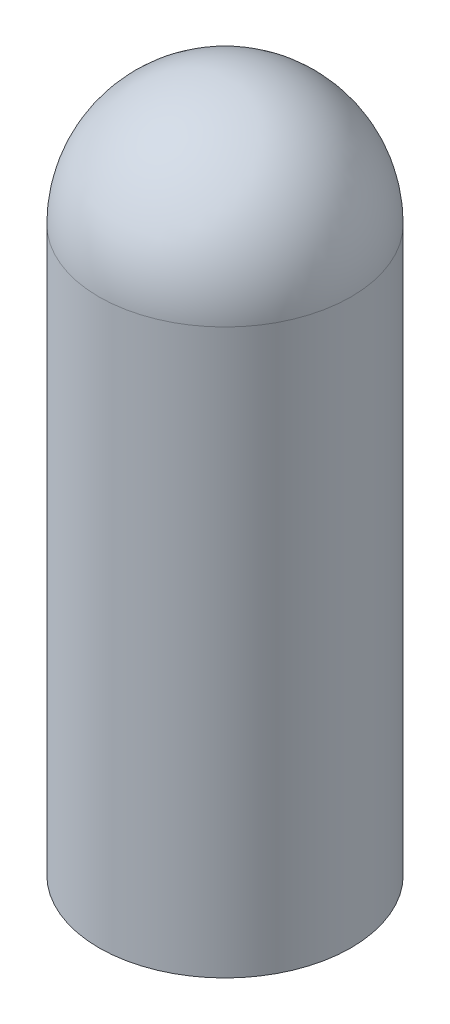
ISO-10303-21;
HEADER;
FILE_DESCRIPTION(('STEP AP214'),'2;1');
FILE_NAME('part.step','',(''),(''),'','','');
FILE_SCHEMA(('AUTOMOTIVE_DESIGN { 1 0 10303 214 1 1 1 1 }'));
ENDSEC;
DATA;
#1=APPLICATION_CONTEXT('core data for automotive mechanical design processes');
#2=APPLICATION_PROTOCOL_DEFINITION('international standard','automotive_design',2000,#1);
#3=PRODUCT_CONTEXT('',#1,'mechanical');
#4=PRODUCT('Part','Part','',(#3));
#5=PRODUCT_RELATED_PRODUCT_CATEGORY('part','',(#4));
#6=PRODUCT_DEFINITION_FORMATION('','',#4);
#7=PRODUCT_DEFINITION_CONTEXT('part definition',#1,'design');
#8=PRODUCT_DEFINITION('design','',#6,#7);
#9=PRODUCT_DEFINITION_SHAPE('','',#8);
#10=(LENGTH_UNIT() NAMED_UNIT(*) SI_UNIT(.MILLI.,.METRE.));
#11=(NAMED_UNIT(*) PLANE_ANGLE_UNIT() SI_UNIT($,.RADIAN.));
#12=(NAMED_UNIT(*) SI_UNIT($,.STERADIAN.) SOLID_ANGLE_UNIT());
#13=UNCERTAINTY_MEASURE_WITH_UNIT(LENGTH_MEASURE(1.E-05),#10,'distance_accuracy_value','');
#14=(GEOMETRIC_REPRESENTATION_CONTEXT(3) GLOBAL_UNCERTAINTY_ASSIGNED_CONTEXT((#13)) GLOBAL_UNIT_ASSIGNED_CONTEXT((#10,
#11,#12)) REPRESENTATION_CONTEXT('',''));
#15=CARTESIAN_POINT('',(0.,0.,0.));
#16=DIRECTION('',(0.,0.,1.));
#17=DIRECTION('',(1.,0.,0.));
#18=AXIS2_PLACEMENT_3D('',#15,#16,#17);
#19=CARTESIAN_POINT('',(0.,0.,0.));
#20=DIRECTION('',(0.,1.,0.));
#21=DIRECTION('',(0.,0.,1.));
#22=AXIS2_PLACEMENT_3D('',#19,#20,#21);
#23=PLANE('',#22);
#24=CARTESIAN_POINT('',(0.,0.,0.));
#25=DIRECTION('',(0.,-1.,0.));
#26=DIRECTION('',(0.,0.,-1.));
#27=AXIS2_PLACEMENT_3D('',#24,#25,#26);
#28=CIRCLE('',#27,9.5);
#29=CARTESIAN_POINT('',(0.,0.,-9.5));
#30=VERTEX_POINT('',#29);
#31=EDGE_CURVE('E44',#30,#30,#28,.T.);
#32=ORIENTED_EDGE('',*,*,#31,.T.);
#33=EDGE_LOOP('',(#32));
#34=FACE_BOUND('',#33,.T.);
#35=ADVANCED_FACE('F32',(#34),#23,.F.);
#36=CARTESIAN_POINT('',(0.,42.5,0.));
#37=DIRECTION('',(0.,-1.,0.));
#38=DIRECTION('',(0.,0.,-1.));
#39=AXIS2_PLACEMENT_3D('',#36,#37,#38);
#40=CYLINDRICAL_SURFACE('',#39,9.5);
#41=ORIENTED_EDGE('',*,*,#31,.F.);
#42=EDGE_LOOP('',(#41));
#43=FACE_BOUND('',#42,.T.);
#44=CARTESIAN_POINT('',(0.,42.5,0.));
#45=DIRECTION('',(0.,-1.,0.));
#46=DIRECTION('',(0.,0.,-1.));
#47=AXIS2_PLACEMENT_3D('',#44,#45,#46);
#48=CIRCLE('',#47,9.5);
#49=CARTESIAN_POINT('',(0.,42.5,-9.5));
#50=VERTEX_POINT('',#49);
#51=EDGE_CURVE('E48',#50,#50,#48,.T.);
#52=ORIENTED_EDGE('',*,*,#51,.T.);
#53=EDGE_LOOP('',(#52));
#54=FACE_BOUND('',#53,.T.);
#55=ADVANCED_FACE('F52',(#43,#54),#40,.T.);
#56=CARTESIAN_POINT('',(0.,42.5,0.));
#57=DIRECTION('',(0.,-1.,0.));
#58=DIRECTION('',(-1.,0.,0.));
#59=AXIS2_PLACEMENT_3D('',#56,#57,#58);
#60=SPHERICAL_SURFACE('',#59,9.5);
#61=ORIENTED_EDGE('',*,*,#51,.F.);
#62=EDGE_LOOP('',(#61));
#63=FACE_BOUND('',#62,.T.);
#64=ADVANCED_FACE('F54',(#63),#60,.T.);
#65=CLOSED_SHELL('',(#35,#55,#64));
#66=CARTESIAN_POINT('',(0.,1.5,0.));
#67=DIRECTION('',(0.,1.,0.));
#68=DIRECTION('',(0.,0.,1.));
#69=AXIS2_PLACEMENT_3D('',#66,#67,#68);
#70=PLANE('',#69);
#71=CARTESIAN_POINT('',(0.,1.5,0.));
#72=DIRECTION('',(0.,1.,0.));
#73=DIRECTION('',(0.,0.,1.));
#74=AXIS2_PLACEMENT_3D('',#71,#72,#73);
#75=CIRCLE('',#74,8.);
#76=CARTESIAN_POINT('',(0.,1.5,8.));
#77=VERTEX_POINT('',#76);
#78=EDGE_CURVE('E36',#77,#77,#75,.F.);
#79=ORIENTED_EDGE('',*,*,#78,.F.);
#80=EDGE_LOOP('',(#79));
#81=FACE_BOUND('',#80,.T.);
#82=ADVANCED_FACE('F69',(#81),#70,.T.);
#83=CARTESIAN_POINT('',(0.,42.5,0.));
#84=DIRECTION('',(0.,-1.,0.));
#85=DIRECTION('',(0.,0.,-1.));
#86=AXIS2_PLACEMENT_3D('',#83,#84,#85);
#87=CYLINDRICAL_SURFACE('',#86,8.);
#88=ORIENTED_EDGE('',*,*,#78,.T.);
#89=EDGE_LOOP('',(#88));
#90=FACE_BOUND('',#89,.T.);
#91=CARTESIAN_POINT('',(0.,42.5,0.));
#92=DIRECTION('',(0.,-1.,0.));
#93=DIRECTION('',(0.,0.,-1.));
#94=AXIS2_PLACEMENT_3D('',#91,#92,#93);
#95=CIRCLE('',#94,8.);
#96=CARTESIAN_POINT('',(0.,42.5,-8.));
#97=VERTEX_POINT('',#96);
#98=EDGE_CURVE('E10',#97,#97,#95,.T.);
#99=ORIENTED_EDGE('',*,*,#98,.F.);
#100=EDGE_LOOP('',(#99));
#101=FACE_BOUND('',#100,.T.);
#102=ADVANCED_FACE('F71',(#90,#101),#87,.F.);
#103=CARTESIAN_POINT('',(0.,42.5,0.));
#104=DIRECTION('',(0.,-1.,0.));
#105=DIRECTION('',(-1.,0.,0.));
#106=AXIS2_PLACEMENT_3D('',#103,#104,#105);
#107=SPHERICAL_SURFACE('',#106,8.);
#108=ORIENTED_EDGE('',*,*,#98,.T.);
#109=EDGE_LOOP('',(#108));
#110=FACE_BOUND('',#109,.T.);
#111=ADVANCED_FACE('F34',(#110),#107,.F.);
#112=CLOSED_SHELL('',(#82,#102,#111));
#113=ORIENTED_CLOSED_SHELL('',*,#112,.T.);
#114=BREP_WITH_VOIDS('B2',#65,(#113));
#115=ADVANCED_BREP_SHAPE_REPRESENTATION('',(#18,#114),#14);
#116=SHAPE_DEFINITION_REPRESENTATION(#9,#115);
ENDSEC;
END-ISO-10303-21;
